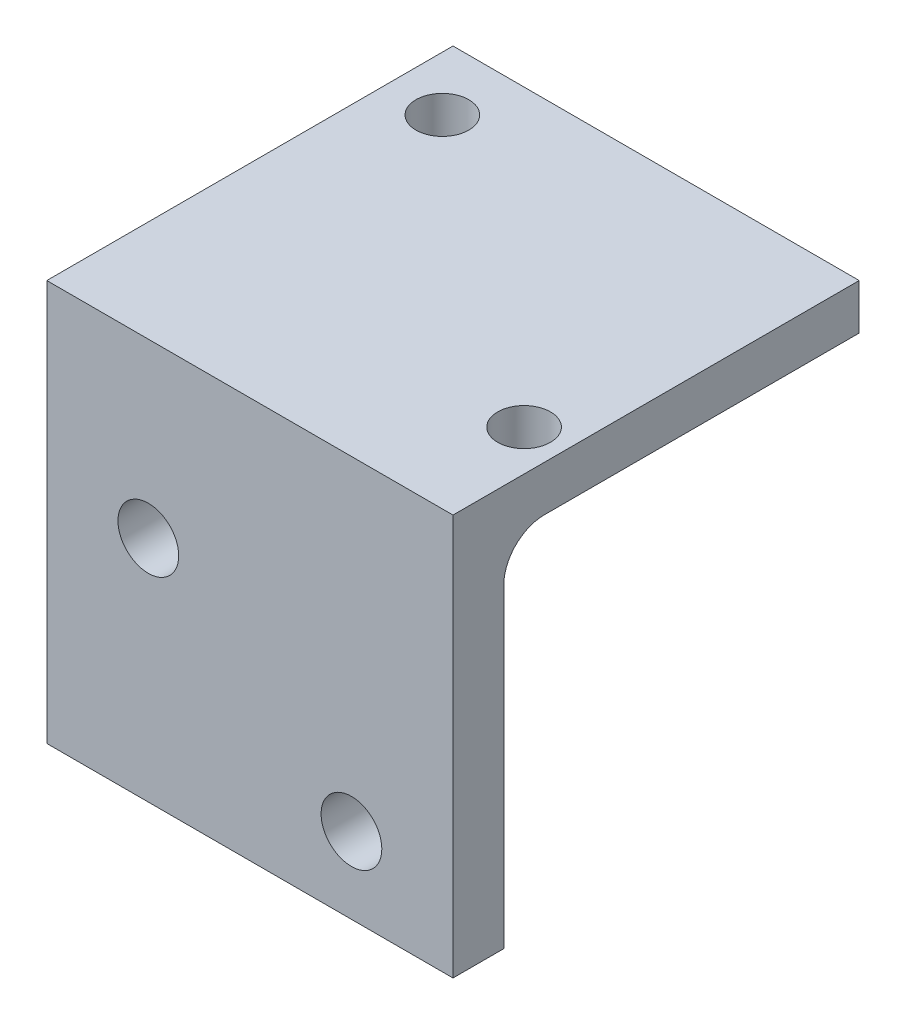
ISO-10303-21;
HEADER;
FILE_DESCRIPTION(('STEP AP214'),'2;1');
FILE_NAME('part.step','',(''),(''),'','','');
FILE_SCHEMA(('AUTOMOTIVE_DESIGN { 1 0 10303 214 1 1 1 1 }'));
ENDSEC;
DATA;
#1=APPLICATION_CONTEXT('core data for automotive mechanical design processes');
#2=APPLICATION_PROTOCOL_DEFINITION('international standard','automotive_design',2000,#1);
#3=PRODUCT_CONTEXT('',#1,'mechanical');
#4=PRODUCT('Part','Part','',(#3));
#5=PRODUCT_RELATED_PRODUCT_CATEGORY('part','',(#4));
#6=PRODUCT_DEFINITION_FORMATION('','',#4);
#7=PRODUCT_DEFINITION_CONTEXT('part definition',#1,'design');
#8=PRODUCT_DEFINITION('design','',#6,#7);
#9=PRODUCT_DEFINITION_SHAPE('','',#8);
#10=(LENGTH_UNIT() NAMED_UNIT(*) SI_UNIT(.MILLI.,.METRE.));
#11=(NAMED_UNIT(*) PLANE_ANGLE_UNIT() SI_UNIT($,.RADIAN.));
#12=(NAMED_UNIT(*) SI_UNIT($,.STERADIAN.) SOLID_ANGLE_UNIT());
#13=UNCERTAINTY_MEASURE_WITH_UNIT(LENGTH_MEASURE(1.E-05),#10,'distance_accuracy_value','');
#14=(GEOMETRIC_REPRESENTATION_CONTEXT(3) GLOBAL_UNCERTAINTY_ASSIGNED_CONTEXT((#13)) GLOBAL_UNIT_ASSIGNED_CONTEXT((#10,
#11,#12)) REPRESENTATION_CONTEXT('',''));
#15=CARTESIAN_POINT('',(0.,0.,0.));
#16=DIRECTION('',(0.,0.,1.));
#17=DIRECTION('',(1.,0.,0.));
#18=AXIS2_PLACEMENT_3D('',#15,#16,#17);
#19=CARTESIAN_POINT('',(0.,0.,0.));
#20=DIRECTION('',(0.,1.,0.));
#21=DIRECTION('',(0.,0.,1.));
#22=AXIS2_PLACEMENT_3D('',#19,#20,#21);
#23=PLANE('',#22);
#24=DIRECTION('',(0.,0.,1.));
#25=VECTOR('',#24,1.);
#26=CARTESIAN_POINT('',(-0.174879010729016,0.,0.));
#27=LINE('',#26,#25);
#28=CARTESIAN_POINT('',(-0.174879010729018,0.,-19.2947768193784));
#29=VERTEX_POINT('',#28);
#30=CARTESIAN_POINT('',(-0.174879010729016,0.,0.390223180621607));
#31=VERTEX_POINT('',#30);
#32=EDGE_CURVE('E143',#29,#31,#27,.T.);
#33=ORIENTED_EDGE('',*,*,#32,.T.);
#34=DIRECTION('',(1.,0.,0.));
#35=VECTOR('',#34,1.);
#36=CARTESIAN_POINT('',(-25.574879010729,0.,0.390223180621603));
#37=LINE('',#36,#35);
#38=CARTESIAN_POINT('',(-1.65993778013843,0.,0.390223180621607));
#39=VERTEX_POINT('',#38);
#40=EDGE_CURVE('E194',#31,#39,#37,.F.);
#41=ORIENTED_EDGE('',*,*,#40,.T.);
#42=CARTESIAN_POINT('',(-2.71487901072902,0.,-0.879776819378402));
#43=DIRECTION('',(0.,1.,0.));
#44=DIRECTION('',(0.,0.,1.));
#45=AXIS2_PLACEMENT_3D('',#42,#43,#44);
#46=CIRCLE('',#45,1.651);
#47=CARTESIAN_POINT('',(-3.7698202413196,0.,0.390223180621606));
#48=VERTEX_POINT('',#47);
#49=EDGE_CURVE('E214',#39,#48,#46,.T.);
#50=ORIENTED_EDGE('',*,*,#49,.T.);
#51=DIRECTION('',(1.,0.,0.));
#52=VECTOR('',#51,1.);
#53=CARTESIAN_POINT('',(-25.574879010729,0.,0.390223180621603));
#54=LINE('',#53,#52);
#55=CARTESIAN_POINT('',(-25.574879010729,0.,0.390223180621603));
#56=VERTEX_POINT('',#55);
#57=EDGE_CURVE('E65',#48,#56,#54,.F.);
#58=ORIENTED_EDGE('',*,*,#57,.T.);
#59=DIRECTION('',(0.,0.,1.));
#60=VECTOR('',#59,1.);
#61=CARTESIAN_POINT('',(-25.574879010729,0.,0.));
#62=LINE('',#61,#60);
#63=CARTESIAN_POINT('',(-25.574879010729,0.,-19.2947768193784));
#64=VERTEX_POINT('',#63);
#65=EDGE_CURVE('E235',#64,#56,#62,.T.);
#66=ORIENTED_EDGE('',*,*,#65,.F.);
#67=DIRECTION('',(-1.,0.,0.));
#68=VECTOR('',#67,1.);
#69=CARTESIAN_POINT('',(0.,0.,-19.2947768193784));
#70=LINE('',#69,#68);
#71=EDGE_CURVE('E229',#29,#64,#70,.T.);
#72=ORIENTED_EDGE('',*,*,#71,.F.);
#73=EDGE_LOOP('',(#33,#41,#50,#58,#66,#72));
#74=FACE_BOUND('',#73,.T.);
#75=CARTESIAN_POINT('',(-22.1757384213511,0.,-15.2307768193784));
#76=DIRECTION('',(0.,1.,0.));
#77=DIRECTION('',(0.,0.,1.));
#78=AXIS2_PLACEMENT_3D('',#75,#76,#77);
#79=CIRCLE('',#78,1.651);
#80=CARTESIAN_POINT('',(-22.1757384213511,0.,-13.5797768193784));
#81=VERTEX_POINT('',#80);
#82=EDGE_CURVE('E140',#81,#81,#79,.T.);
#83=ORIENTED_EDGE('',*,*,#82,.T.);
#84=EDGE_LOOP('',(#83));
#85=FACE_BOUND('',#84,.T.);
#86=ADVANCED_FACE('F37',(#74,#85),#23,.F.);
#87=CARTESIAN_POINT('',(-0.174879010729016,2.8448,0.));
#88=DIRECTION('',(1.,0.,0.));
#89=DIRECTION('',(0.,0.,-1.));
#90=AXIS2_PLACEMENT_3D('',#87,#88,#89);
#91=PLANE('',#90);
#92=ORIENTED_EDGE('',*,*,#32,.F.);
#93=DIRECTION('',(0.,-1.,0.));
#94=VECTOR('',#93,1.);
#95=CARTESIAN_POINT('',(-0.174879010729018,2.8448,-19.2947768193784));
#96=LINE('',#95,#94);
#97=CARTESIAN_POINT('',(-0.174879010729018,2.8448,-19.2947768193784));
#98=VERTEX_POINT('',#97);
#99=EDGE_CURVE('E154',#98,#29,#96,.T.);
#100=ORIENTED_EDGE('',*,*,#99,.F.);
#101=DIRECTION('',(0.,0.,1.));
#102=VECTOR('',#101,1.);
#103=CARTESIAN_POINT('',(-0.174879010729016,2.8448,0.));
#104=LINE('',#103,#102);
#105=CARTESIAN_POINT('',(-0.174879010729016,2.8448,6.1052231806216));
#106=VERTEX_POINT('',#105);
#107=EDGE_CURVE('E213',#98,#106,#104,.T.);
#108=ORIENTED_EDGE('',*,*,#107,.T.);
#109=DIRECTION('',(0.,-1.,0.));
#110=VECTOR('',#109,1.);
#111=CARTESIAN_POINT('',(-0.174879010729016,2.8448,6.1052231806216));
#112=LINE('',#111,#110);
#113=CARTESIAN_POINT('',(-0.174879010729018,-22.225,6.10522318062161));
#114=VERTEX_POINT('',#113);
#115=EDGE_CURVE('E206',#106,#114,#112,.T.);
#116=ORIENTED_EDGE('',*,*,#115,.T.);
#117=DIRECTION('',(0.,0.,1.));
#118=VECTOR('',#117,1.);
#119=CARTESIAN_POINT('',(-0.174879010729018,-22.225,6.10522318062161));
#120=LINE('',#119,#118);
#121=CARTESIAN_POINT('',(-0.174879010729018,-22.225,2.93022318062161));
#122=VERTEX_POINT('',#121);
#123=EDGE_CURVE('E126',#122,#114,#120,.T.);
#124=ORIENTED_EDGE('',*,*,#123,.F.);
#125=DIRECTION('',(0.,1.,0.));
#126=VECTOR('',#125,1.);
#127=CARTESIAN_POINT('',(-0.174879010729018,-22.225,2.93022318062161));
#128=LINE('',#127,#126);
#129=CARTESIAN_POINT('',(-0.174879010729018,-2.54,2.93022318062161));
#130=VERTEX_POINT('',#129);
#131=EDGE_CURVE('E122',#122,#130,#128,.T.);
#132=ORIENTED_EDGE('',*,*,#131,.T.);
#133=CARTESIAN_POINT('',(-0.174879010729018,-2.54,0.390223180621607));
#134=DIRECTION('',(1.,0.,0.));
#135=DIRECTION('',(0.,0.,-1.));
#136=AXIS2_PLACEMENT_3D('',#133,#134,#135);
#137=CIRCLE('',#136,2.54);
#138=EDGE_CURVE('E50',#130,#31,#137,.F.);
#139=ORIENTED_EDGE('',*,*,#138,.T.);
#140=EDGE_LOOP('',(#92,#100,#108,#116,#124,#132,#139));
#141=FACE_BOUND('',#140,.T.);
#142=ADVANCED_FACE('F204',(#141),#91,.T.);
#143=CARTESIAN_POINT('',(0.,2.8448,-19.2947768193784));
#144=DIRECTION('',(0.,0.,1.));
#145=DIRECTION('',(1.,0.,0.));
#146=AXIS2_PLACEMENT_3D('',#143,#144,#145);
#147=PLANE('',#146);
#148=ORIENTED_EDGE('',*,*,#71,.T.);
#149=DIRECTION('',(0.,-1.,0.));
#150=VECTOR('',#149,1.);
#151=CARTESIAN_POINT('',(-25.574879010729,2.8448,-19.2947768193784));
#152=LINE('',#151,#150);
#153=CARTESIAN_POINT('',(-25.574879010729,2.8448,-19.2947768193784));
#154=VERTEX_POINT('',#153);
#155=EDGE_CURVE('E241',#154,#64,#152,.T.);
#156=ORIENTED_EDGE('',*,*,#155,.F.);
#157=DIRECTION('',(-1.,0.,0.));
#158=VECTOR('',#157,1.);
#159=CARTESIAN_POINT('',(0.,2.8448,-19.2947768193784));
#160=LINE('',#159,#158);
#161=EDGE_CURVE('E216',#98,#154,#160,.T.);
#162=ORIENTED_EDGE('',*,*,#161,.F.);
#163=ORIENTED_EDGE('',*,*,#99,.T.);
#164=EDGE_LOOP('',(#148,#156,#162,#163));
#165=FACE_BOUND('',#164,.T.);
#166=ADVANCED_FACE('F248',(#165),#147,.F.);
#167=CARTESIAN_POINT('',(-25.574879010729,2.8448,0.));
#168=DIRECTION('',(1.,0.,0.));
#169=DIRECTION('',(0.,0.,-1.));
#170=AXIS2_PLACEMENT_3D('',#167,#168,#169);
#171=PLANE('',#170);
#172=ORIENTED_EDGE('',*,*,#65,.T.);
#173=CARTESIAN_POINT('',(-25.574879010729,-2.54,0.390223180621603));
#174=DIRECTION('',(1.,0.,0.));
#175=DIRECTION('',(0.,0.,-1.));
#176=AXIS2_PLACEMENT_3D('',#173,#174,#175);
#177=CIRCLE('',#176,2.54);
#178=CARTESIAN_POINT('',(-25.574879010729,-2.54,2.9302231806216));
#179=VERTEX_POINT('',#178);
#180=EDGE_CURVE('E11',#56,#179,#177,.T.);
#181=ORIENTED_EDGE('',*,*,#180,.T.);
#182=DIRECTION('',(0.,1.,0.));
#183=VECTOR('',#182,1.);
#184=CARTESIAN_POINT('',(-25.574879010729,-22.225,2.9302231806216));
#185=LINE('',#184,#183);
#186=CARTESIAN_POINT('',(-25.574879010729,-22.225,2.9302231806216));
#187=VERTEX_POINT('',#186);
#188=EDGE_CURVE('E120',#187,#179,#185,.T.);
#189=ORIENTED_EDGE('',*,*,#188,.F.);
#190=DIRECTION('',(0.,0.,-1.));
#191=VECTOR('',#190,1.);
#192=CARTESIAN_POINT('',(-25.574879010729,-22.225,6.1052231806216));
#193=LINE('',#192,#191);
#194=CARTESIAN_POINT('',(-25.574879010729,-22.225,6.1052231806216));
#195=VERTEX_POINT('',#194);
#196=EDGE_CURVE('E127',#195,#187,#193,.T.);
#197=ORIENTED_EDGE('',*,*,#196,.F.);
#198=DIRECTION('',(0.,-1.,0.));
#199=VECTOR('',#198,1.);
#200=CARTESIAN_POINT('',(-25.574879010729,2.8448,6.1052231806216));
#201=LINE('',#200,#199);
#202=CARTESIAN_POINT('',(-25.574879010729,2.8448,6.1052231806216));
#203=VERTEX_POINT('',#202);
#204=EDGE_CURVE('E240',#203,#195,#201,.T.);
#205=ORIENTED_EDGE('',*,*,#204,.F.);
#206=DIRECTION('',(0.,0.,1.));
#207=VECTOR('',#206,1.);
#208=CARTESIAN_POINT('',(-25.574879010729,2.8448,0.));
#209=LINE('',#208,#207);
#210=EDGE_CURVE('E219',#154,#203,#209,.T.);
#211=ORIENTED_EDGE('',*,*,#210,.F.);
#212=ORIENTED_EDGE('',*,*,#155,.T.);
#213=EDGE_LOOP('',(#172,#181,#189,#197,#205,#211,#212));
#214=FACE_BOUND('',#213,.T.);
#215=ADVANCED_FACE('F138',(#214),#171,.F.);
#216=CARTESIAN_POINT('',(0.,2.8448,6.1052231806216));
#217=DIRECTION('',(0.,0.,1.));
#218=DIRECTION('',(1.,0.,0.));
#219=AXIS2_PLACEMENT_3D('',#216,#217,#218);
#220=PLANE('',#219);
#221=CARTESIAN_POINT('',(-6.52487901072902,-17.4625,6.1052231806216));
#222=DIRECTION('',(0.,0.,1.));
#223=DIRECTION('',(1.,0.,0.));
#224=AXIS2_PLACEMENT_3D('',#221,#222,#223);
#225=CIRCLE('',#224,1.89864999999999);
#226=CARTESIAN_POINT('',(-4.62622901072903,-17.4625,6.1052231806216));
#227=VERTEX_POINT('',#226);
#228=EDGE_CURVE('E280',#227,#227,#225,.T.);
#229=ORIENTED_EDGE('',*,*,#228,.F.);
#230=EDGE_LOOP('',(#229));
#231=FACE_BOUND('',#230,.T.);
#232=CARTESIAN_POINT('',(-19.224879010729,-7.9375,6.1052231806216));
#233=DIRECTION('',(0.,0.,1.));
#234=DIRECTION('',(1.,0.,0.));
#235=AXIS2_PLACEMENT_3D('',#232,#233,#234);
#236=CIRCLE('',#235,1.89864999999999);
#237=CARTESIAN_POINT('',(-17.326229010729,-7.9375,6.1052231806216));
#238=VERTEX_POINT('',#237);
#239=EDGE_CURVE('E191',#238,#238,#236,.T.);
#240=ORIENTED_EDGE('',*,*,#239,.F.);
#241=EDGE_LOOP('',(#240));
#242=FACE_BOUND('',#241,.T.);
#243=ORIENTED_EDGE('',*,*,#204,.T.);
#244=DIRECTION('',(-1.,0.,0.));
#245=VECTOR('',#244,1.);
#246=CARTESIAN_POINT('',(-25.574879010729,-22.225,6.1052231806216));
#247=LINE('',#246,#245);
#248=EDGE_CURVE('E133',#114,#195,#247,.T.);
#249=ORIENTED_EDGE('',*,*,#248,.F.);
#250=ORIENTED_EDGE('',*,*,#115,.F.);
#251=DIRECTION('',(-1.,0.,0.));
#252=VECTOR('',#251,1.);
#253=CARTESIAN_POINT('',(0.,2.8448,6.1052231806216));
#254=LINE('',#253,#252);
#255=EDGE_CURVE('E221',#106,#203,#254,.T.);
#256=ORIENTED_EDGE('',*,*,#255,.T.);
#257=EDGE_LOOP('',(#243,#249,#250,#256));
#258=FACE_BOUND('',#257,.T.);
#259=ADVANCED_FACE('F261',(#231,#242,#258),#220,.T.);
#260=CARTESIAN_POINT('',(-22.1757384213511,2.8448,-15.2307768193784));
#261=DIRECTION('',(0.,-1.,0.));
#262=DIRECTION('',(0.,0.,-1.));
#263=AXIS2_PLACEMENT_3D('',#260,#261,#262);
#264=CYLINDRICAL_SURFACE('',#263,1.651);
#265=CARTESIAN_POINT('',(-22.1757384213511,2.8448,-15.2307768193784));
#266=DIRECTION('',(0.,1.,0.));
#267=DIRECTION('',(0.,0.,1.));
#268=AXIS2_PLACEMENT_3D('',#265,#266,#267);
#269=CIRCLE('',#268,1.651);
#270=CARTESIAN_POINT('',(-22.1757384213511,2.8448,-13.5797768193784));
#271=VERTEX_POINT('',#270);
#272=EDGE_CURVE('E210',#271,#271,#269,.T.);
#273=ORIENTED_EDGE('',*,*,#272,.T.);
#274=EDGE_LOOP('',(#273));
#275=FACE_BOUND('',#274,.T.);
#276=ORIENTED_EDGE('',*,*,#82,.F.);
#277=EDGE_LOOP('',(#276));
#278=FACE_BOUND('',#277,.T.);
#279=ADVANCED_FACE('F170',(#275,#278),#264,.F.);
#280=CARTESIAN_POINT('',(-2.71487901072902,2.8448,-0.879776819378402));
#281=DIRECTION('',(0.,-1.,0.));
#282=DIRECTION('',(0.,0.,-1.));
#283=AXIS2_PLACEMENT_3D('',#280,#281,#282);
#284=CYLINDRICAL_SURFACE('',#283,1.651);
#285=CARTESIAN_POINT('',(-2.71487901072902,2.8448,-0.879776819378402));
#286=DIRECTION('',(0.,1.,0.));
#287=DIRECTION('',(0.,0.,1.));
#288=AXIS2_PLACEMENT_3D('',#285,#286,#287);
#289=CIRCLE('',#288,1.651);
#290=CARTESIAN_POINT('',(-2.71487901072902,2.8448,0.771223180621597));
#291=VERTEX_POINT('',#290);
#292=EDGE_CURVE('E224',#291,#291,#289,.T.);
#293=ORIENTED_EDGE('',*,*,#292,.T.);
#294=EDGE_LOOP('',(#293));
#295=FACE_BOUND('',#294,.T.);
#296=ORIENTED_EDGE('',*,*,#49,.F.);
#297=EDGE_CURVE('E201',#48,#39,#46,.T.);
#298=ORIENTED_EDGE('',*,*,#297,.F.);
#299=EDGE_LOOP('',(#296,#298));
#300=FACE_BOUND('',#299,.T.);
#301=ADVANCED_FACE('F183',(#295,#300),#284,.F.);
#302=CARTESIAN_POINT('',(0.,2.8448,0.));
#303=DIRECTION('',(0.,1.,0.));
#304=DIRECTION('',(0.,0.,1.));
#305=AXIS2_PLACEMENT_3D('',#302,#303,#304);
#306=PLANE('',#305);
#307=ORIENTED_EDGE('',*,*,#272,.F.);
#308=EDGE_LOOP('',(#307));
#309=FACE_BOUND('',#308,.T.);
#310=ORIENTED_EDGE('',*,*,#107,.F.);
#311=ORIENTED_EDGE('',*,*,#161,.T.);
#312=ORIENTED_EDGE('',*,*,#210,.T.);
#313=ORIENTED_EDGE('',*,*,#255,.F.);
#314=EDGE_LOOP('',(#310,#311,#312,#313));
#315=FACE_BOUND('',#314,.T.);
#316=ORIENTED_EDGE('',*,*,#292,.F.);
#317=EDGE_LOOP('',(#316));
#318=FACE_BOUND('',#317,.T.);
#319=ADVANCED_FACE('F254',(#309,#315,#318),#306,.T.);
#320=CARTESIAN_POINT('',(-25.574879010729,-22.225,2.9302231806216));
#321=DIRECTION('',(0.,0.,1.));
#322=DIRECTION('',(1.,0.,0.));
#323=AXIS2_PLACEMENT_3D('',#320,#321,#322);
#324=PLANE('',#323);
#325=CARTESIAN_POINT('',(-6.52487901072902,-17.4625,2.93022318062161));
#326=DIRECTION('',(0.,0.,-1.));
#327=DIRECTION('',(-1.,0.,0.));
#328=AXIS2_PLACEMENT_3D('',#325,#326,#327);
#329=CIRCLE('',#328,1.89864999999999);
#330=CARTESIAN_POINT('',(-8.42352901072901,-17.4625,2.93022318062161));
#331=VERTEX_POINT('',#330);
#332=EDGE_CURVE('E295',#331,#331,#329,.T.);
#333=ORIENTED_EDGE('',*,*,#332,.F.);
#334=EDGE_LOOP('',(#333));
#335=FACE_BOUND('',#334,.T.);
#336=CARTESIAN_POINT('',(-19.224879010729,-7.9375,2.9302231806216));
#337=DIRECTION('',(0.,0.,-1.));
#338=DIRECTION('',(-1.,0.,0.));
#339=AXIS2_PLACEMENT_3D('',#336,#337,#338);
#340=CIRCLE('',#339,1.89864999999999);
#341=CARTESIAN_POINT('',(-21.123529010729,-7.9375,2.9302231806216));
#342=VERTEX_POINT('',#341);
#343=EDGE_CURVE('E289',#342,#342,#340,.T.);
#344=ORIENTED_EDGE('',*,*,#343,.F.);
#345=EDGE_LOOP('',(#344));
#346=FACE_BOUND('',#345,.T.);
#347=ORIENTED_EDGE('',*,*,#188,.T.);
#348=DIRECTION('',(1.,0.,0.));
#349=VECTOR('',#348,1.);
#350=CARTESIAN_POINT('',(-0.174879010729018,-2.54,2.93022318062161));
#351=LINE('',#350,#349);
#352=CARTESIAN_POINT('',(-3.7698202413196,-2.54,2.93022318062161));
#353=VERTEX_POINT('',#352);
#354=EDGE_CURVE('E161',#179,#353,#351,.T.);
#355=ORIENTED_EDGE('',*,*,#354,.T.);
#356=CARTESIAN_POINT('',(-4.78046517238045,-2.41927019892084,2.93022318062161));
#357=CARTESIAN_POINT('',(-3.99617103158453,0.459293182931303,2.93022318062161));
#358=CARTESIAN_POINT('',(-4.1213101737523,0.,-0.0150500511579507));
#359=CARTESIAN_POINT('',(-4.72988987343305,-2.4330551308912,2.93022318062161));
#360=CARTESIAN_POINT('',(-4.00015061990601,0.441268070383023,2.93022318062161));
#361=CARTESIAN_POINT('',(-4.11184935456264,0.,0.000310450198388794));
#362=CARTESIAN_POINT('',(-4.67896269357026,-2.44551844006793,2.93022318062161));
#363=CARTESIAN_POINT('',(-4.00237563415633,0.421973515309005,2.93022318062161));
#364=CARTESIAN_POINT('',(-4.10159513334371,0.,0.0164495946423353));
#365=CARTESIAN_POINT('',(-4.57657613516394,-2.46791341952693,2.93022318062161));
#366=CARTESIAN_POINT('',(-4.00262718154944,0.381212904278227,2.93022318062161));
#367=CARTESIAN_POINT('',(-4.07907939563001,0.,0.0503763433396225));
#368=CARTESIAN_POINT('',(-4.52511699163838,-2.47784616190466,2.93022318062161));
#369=CARTESIAN_POINT('',(-4.00068775020279,0.359778117955345,2.93022318062161));
#370=CARTESIAN_POINT('',(-4.06681873280851,0.,0.0681632451372429));
#371=CARTESIAN_POINT('',(-4.42206118482059,-2.49525812395143,2.93022318062161));
#372=CARTESIAN_POINT('',(-3.99207350452714,0.315134175868423,2.93022318062161));
#373=CARTESIAN_POINT('',(-4.03993178780481,0.,0.1053933503395));
#374=CARTESIAN_POINT('',(-4.37046659768933,-2.50274972676771,2.93022318062161));
#375=CARTESIAN_POINT('',(-3.98546506186709,0.291965998608472,2.93022318062161));
#376=CARTESIAN_POINT('',(-4.02531802534768,0.,0.124827543473096));
#377=CARTESIAN_POINT('',(-4.26700274956601,-2.51551354936821,2.93022318062161));
#378=CARTESIAN_POINT('',(-3.96696759121091,0.244158137884545,2.93022318062161));
#379=CARTESIAN_POINT('',(-3.9931386225148,0.,0.165458670089539));
#380=CARTESIAN_POINT('',(-4.21513346262697,-2.52078555557149,2.93022318062161));
#381=CARTESIAN_POINT('',(-3.95513033854321,0.219546591780559,2.93022318062161));
#382=CARTESIAN_POINT('',(-3.9755726982944,0.,0.186655772973673));
#383=CARTESIAN_POINT('',(-4.05930889817225,-2.53354903938179,2.93022318062161));
#384=CARTESIAN_POINT('',(-3.91104737666477,0.144509915440862,2.93022318062161));
#385=CARTESIAN_POINT('',(-3.91752799359861,0.,0.252899623953501));
#386=CARTESIAN_POINT('',(-3.95509886050122,-2.53799411721139,2.93022318062161));
#387=CARTESIAN_POINT('',(-3.87019750325805,0.0923138824528808,2.93022318062161));
#388=CARTESIAN_POINT('',(-3.87169328127576,0.,0.300612576212144));
#389=CARTESIAN_POINT('',(-3.7986892634634,-2.54017655621838,2.93022318062161));
#390=CARTESIAN_POINT('',(-3.78781852789429,0.0142974384544925,2.93022318062161));
#391=CARTESIAN_POINT('',(-3.78749145238243,0.,0.375885062061884));
#392=CARTESIAN_POINT('',(-3.74649055182562,-2.54015448692261,2.93022318062161));
#393=CARTESIAN_POINT('',(-3.75712677086065,-0.0114797409311745,2.93022318062161));
#394=CARTESIAN_POINT('',(-3.75681507064494,0.,0.401617582189808));
#395=CARTESIAN_POINT('',(-3.64210496986102,-2.53896818025468,2.93022318062161));
#396=CARTESIAN_POINT('',(-3.68863190353018,-0.0619282436335028,2.93022318062161));
#397=CARTESIAN_POINT('',(-3.68943447512539,0.,0.453588028416098));
#398=CARTESIAN_POINT('',(-3.58991809937911,-2.53780395882217,2.93022318062161));
#399=CARTESIAN_POINT('',(-3.65090132539279,-0.086609548509501,2.93022318062161));
#400=CARTESIAN_POINT('',(-3.65273034547144,0.,0.4798259474562));
#401=CARTESIAN_POINT('',(-3.47020136390445,-2.53426918441061,2.93022318062161));
#402=CARTESIAN_POINT('',(-3.55621236341486,-0.140830305484294,2.93022318062161));
#403=CARTESIAN_POINT('',(-3.56072409579566,0.,0.539438243849741));
#404=CARTESIAN_POINT('',(-3.40268011612729,-2.53164430793399,2.93022318062161));
#405=CARTESIAN_POINT('',(-3.49679383359444,-0.169813417176816,2.93022318062161));
#406=CARTESIAN_POINT('',(-3.50312841221571,0.,0.572638174300059));
#407=CARTESIAN_POINT('',(-3.26764885136141,-2.52607794318948,2.93022318062161));
#408=CARTESIAN_POINT('',(-3.36666073212336,-0.222073489227773,2.93022318062161));
#409=CARTESIAN_POINT('',(-3.37576357886264,0.,0.63482937591095));
#410=CARTESIAN_POINT('',(-3.20013883509968,-2.5231364391566,2.93022318062161));
#411=CARTESIAN_POINT('',(-3.29596055852153,-0.245458596126369,2.93022318062161));
#412=CARTESIAN_POINT('',(-3.30599382283066,0.,0.663820437341497));
#413=CARTESIAN_POINT('',(-3.06518762879163,-2.51788510806121,2.93022318062161));
#414=CARTESIAN_POINT('',(-3.14566425692161,-0.284205958568586,2.93022318062161));
#415=CARTESIAN_POINT('',(-3.15560554121882,0.,0.713265455784777));
#416=CARTESIAN_POINT('',(-2.99774647750001,-2.51557438812208,2.93022318062161));
#417=CARTESIAN_POINT('',(-3.06592808918627,-0.29970789839991,2.93022318062161));
#418=CARTESIAN_POINT('',(-3.07500259394808,0.,0.733731501803916));
#419=CARTESIAN_POINT('',(-2.86283493836761,-2.51232056984434,2.93022318062161));
#420=CARTESIAN_POINT('',(-2.90143503152716,-0.320974929494095,2.93022318062161));
#421=CARTESIAN_POINT('',(-2.90693915777874,0.,0.762217452793961));
#422=CARTESIAN_POINT('',(-2.79536455467003,-2.51137731766128,2.93022318062161));
#423=CARTESIAN_POINT('',(-2.81634899665468,-0.326834593474441,2.93022318062161));
#424=CARTESIAN_POINT('',(-2.81947944145543,0.,0.770238757844595));
#425=CARTESIAN_POINT('',(-2.66041083505012,-2.51116775909808,2.93022318062161));
#426=CARTESIAN_POINT('',(-2.64623834105261,-0.328150285513753,2.93022318062161));
#427=CARTESIAN_POINT('',(-2.64409938695758,0.,0.772034393594719));
#428=CARTESIAN_POINT('',(-2.59292749869514,-2.51190170244486,2.93022318062161));
#429=CARTESIAN_POINT('',(-2.56079907243759,-0.323611171546179,2.93022318062161));
#430=CARTESIAN_POINT('',(-2.55617898213326,0.,0.765806602667314));
#431=CARTESIAN_POINT('',(-2.45798817953841,-2.51480558875327,2.93022318062161));
#432=CARTESIAN_POINT('',(-2.3950266818916,-0.304807037794562,2.93022318062161));
#433=CARTESIAN_POINT('',(-2.38647225200227,0.,0.740513452416084));
#434=CARTESIAN_POINT('',(-2.39053220038258,-2.51697568351553,2.93022318062161));
#435=CARTESIAN_POINT('',(-2.31434602871764,-0.290456349685507,2.93022318062161));
#436=CARTESIAN_POINT('',(-2.30468657615152,0.,0.721446736019281));
#437=CARTESIAN_POINT('',(-2.25555077542842,-2.52205731887145,2.93022318062161));
#438=CARTESIAN_POINT('',(-2.16178951993331,-0.253739680769598,2.93022318062161));
#439=CARTESIAN_POINT('',(-2.15157569403419,0.,0.674234979358684));
#440=CARTESIAN_POINT('',(-2.18802537598725,-2.5249699599793,2.93022318062161));
#441=CARTESIAN_POINT('',(-2.08974949288827,-0.231234014430854,2.93022318062161));
#442=CARTESIAN_POINT('',(-2.08026626385364,0.,0.64607644763109));
#443=CARTESIAN_POINT('',(-2.05296756566441,-2.53060246315846,2.93022318062161));
#444=CARTESIAN_POINT('',(-1.95677655747245,-0.18043910131438,2.93022318062161));
#445=CARTESIAN_POINT('',(-1.94980677135164,0.,0.585036384060931));
#446=CARTESIAN_POINT('',(-1.98543515510527,-2.53332233188166,2.93022318062161));
#447=CARTESIAN_POINT('',(-1.89583959953763,-0.15203671325964,2.93022318062161));
#448=CARTESIAN_POINT('',(-1.89065628933444,0.,0.552155015305176));
#449=CARTESIAN_POINT('',(-1.86352406457785,-2.53719801945049,2.93022318062161));
#450=CARTESIAN_POINT('',(-1.79666122514193,-0.0976206435572603,2.93022318062161));
#451=CARTESIAN_POINT('',(-1.79433183551406,0.,0.491705962159114));
#452=CARTESIAN_POINT('',(-1.80915244809063,-2.53855556182021,2.93022318062161));
#453=CARTESIAN_POINT('',(-1.75627841955207,-0.0721312839493183,2.93022318062161));
#454=CARTESIAN_POINT('',(-1.75512198790755,0.,0.46435477031628));
#455=CARTESIAN_POINT('',(-1.70038996354569,-2.54007732489508,2.93022318062161));
#456=CARTESIAN_POINT('',(-1.68310325538982,-0.0198687361202487,2.93022318062161));
#457=CARTESIAN_POINT('',(-1.68335211124524,0.,0.410098489312347));
#458=CARTESIAN_POINT('',(-1.6459990956757,-2.54024155693347,2.93022318062161));
#459=CARTESIAN_POINT('',(-1.6503914622273,0.00691790231815304,2.93022318062161));
#460=CARTESIAN_POINT('',(-1.65079201903744,0.,0.383193395916931));
#461=CARTESIAN_POINT('',(-1.53732903509732,-2.53898091032034,2.93022318062161));
#462=CARTESIAN_POINT('',(-1.59229465003887,0.0608131486226801,2.93022318062161));
#463=CARTESIAN_POINT('',(-1.59141648016262,0.,0.330677937622025));
#464=CARTESIAN_POINT('',(-1.48304981596339,-2.53755886023482,2.93022318062161));
#465=CARTESIAN_POINT('',(-1.56698257458702,0.0879165111799446,2.93022318062161));
#466=CARTESIAN_POINT('',(-1.5645909095269,0.,0.305065352997682));
#467=CARTESIAN_POINT('',(-1.37457656318478,-2.53279587327978,2.93022318062161));
#468=CARTESIAN_POINT('',(-1.5231274729156,0.141721530836342,2.93022318062161));
#469=CARTESIAN_POINT('',(-1.51567142745444,0.,0.255526268517891));
#470=CARTESIAN_POINT('',(-1.32038252278335,-2.52945509720709,2.93022318062161));
#471=CARTESIAN_POINT('',(-1.50466540903339,0.168404555082033,2.93022318062161));
#472=CARTESIAN_POINT('',(-1.49357711973212,0.,0.231599627562312));
#473=CARTESIAN_POINT('',(-1.21216240870825,-2.52057684725247,2.93022318062161));
#474=CARTESIAN_POINT('',(-1.47393718886212,0.220734838387683,2.93022318062161));
#475=CARTESIAN_POINT('',(-1.45327125017285,0.,0.185625009502021));
#476=CARTESIAN_POINT('',(-1.15813636314382,-2.51503902379525,2.93022318062161));
#477=CARTESIAN_POINT('',(-1.46174323376072,0.246354331770841,2.93022318062161));
#478=CARTESIAN_POINT('',(-1.43506030693274,0.,0.163577332040319));
#479=CARTESIAN_POINT('',(-1.05039028289814,-2.50154368299507,2.93022318062161));
#480=CARTESIAN_POINT('',(-1.44294766076644,0.296026908783885,2.93022318062161));
#481=CARTESIAN_POINT('',(-1.40181053251364,0.,0.121408112162926));
#482=CARTESIAN_POINT('',(-0.996670215816603,-2.49358642688955,2.93022318062161));
#483=CARTESIAN_POINT('',(-1.43640407119766,0.320047824346108,2.93022318062161));
#484=CARTESIAN_POINT('',(-1.38677135916062,0.,0.101286362104102));
#485=CARTESIAN_POINT('',(-0.889359346304556,-2.47501834013881,2.93022318062161));
#486=CARTESIAN_POINT('',(-1.42825615026559,0.366237090232189,2.93022318062161));
#487=CARTESIAN_POINT('',(-1.35918209211028,0.,0.0628016207182083));
#488=CARTESIAN_POINT('',(-0.835771186789722,-2.46439209602165,2.93022318062161));
#489=CARTESIAN_POINT('',(-1.42672815694721,0.388357792029464,2.93022318062161));
#490=CARTESIAN_POINT('',(-1.34664724331007,0.,0.0444497333176707));
#491=CARTESIAN_POINT('',(-0.729192150257619,-2.44037637821705,2.93022318062161));
#492=CARTESIAN_POINT('',(-1.42808354249572,0.430273102637092,2.93022318062161));
#493=CARTESIAN_POINT('',(-1.32370231360652,0.,0.00952052109820819));
#494=CARTESIAN_POINT('',(-0.676201571412126,-2.42698558432246,2.93022318062161));
#495=CARTESIAN_POINT('',(-1.43100424186966,0.450032331009209,2.93022318062161));
#496=CARTESIAN_POINT('',(-1.3132932526121,0.,-0.00705595010758302));
#497=CARTESIAN_POINT('',(-0.623608746671595,-2.41215072651113,2.93022318062161));
#498=CARTESIAN_POINT('',(-1.43577828032422,0.468393662619365,2.93022318062161));
#499=CARTESIAN_POINT('',(-1.30371468013431,0.,-0.0227959374112564));
#500=(BOUNDED_SURFACE() B_SPLINE_SURFACE(3,2,((#356,#357,#358),(#359,#360,#361),(#362,#363,
#364),(#365,#366,#367),(#368,#369,#370),(#371,#372,#373),(#374,#375,#376),(#377,#378,#379),
(#380,#381,#382),(#383,#384,#385),(#386,#387,#388),(#389,#390,#391),(#392,#393,#394),(#395,#396,
#397),(#398,#399,#400),(#401,#402,#403),(#404,#405,#406),(#407,#408,#409),(#410,#411,#412),
(#413,#414,#415),(#416,#417,#418),(#419,#420,#421),(#422,#423,#424),(#425,#426,#427),(#428,#429,
#430),(#431,#432,#433),(#434,#435,#436),(#437,#438,#439),(#440,#441,#442),(#443,#444,#445),
(#446,#447,#448),(#449,#450,#451),(#452,#453,#454),(#455,#456,#457),(#458,#459,#460),(#461,#462,
#463),(#464,#465,#466),(#467,#468,#469),(#470,#471,#472),(#473,#474,#475),(#476,#477,#478),
(#479,#480,#481),(#482,#483,#484),(#485,#486,#487),(#488,#489,#490),(#491,#492,#493),(#494,#495,
#496),(#497,#498,#499)),.UNSPECIFIED.,.F.,.F.,.F.) B_SPLINE_SURFACE_WITH_KNOTS((4,2,2,2,2,2,2,2,
2,2,2,2,2,2,2,2,2,2,2,2,2,2,2,4),(3,3),(0.,0.157231273416072,0.314395823321791,0.47075024407719,
0.627119706618246,0.939743336660921,1.09633367204704,1.25292182211793,1.45563483066435,
1.65835793703573,1.86079258253384,2.06320445172813,2.26564646110902,2.46810987194711,
2.67087511241173,2.87363335276405,3.03679045910279,3.19994601588421,3.36281110756972,
3.52566255250751,3.68853991936468,3.85139970583273,4.01522255219587,4.17912381366522),(0.,1.),
.UNSPECIFIED.) GEOMETRIC_REPRESENTATION_ITEM() RATIONAL_B_SPLINE_SURFACE(((1.,0.648245173347094,
1.),(1.,0.650577211853146,1.),(1.,0.653015265303103,1.),(1.,0.6581090908866,1.),(1.,
0.660764770188807,1.),(1.,0.666287234118297,1.),(1.,0.669152860007642,1.),(1.,0.675102905803961,
1.),(1.,0.678187346733085,1.),(1.,0.687755797935047,1.),(1.,0.694556976827656,1.),(1.,
0.705117060725819,1.),(1.,0.708700151409716,1.),(1.,0.715881462728337,1.),(1.,0.719479683151214,
1.),(1.,0.727594521707913,1.),(1.,0.732069459399554,1.),(1.,0.740383792265461,1.),(1.,
0.744223155770087,1.),(1.,0.750734185678078,1.),(1.,0.753407505859482,1.),(1.,0.757120194752568,
1.),(1.,0.758159747269371,1.),(1.,0.758392858864644,1.),(1.,0.757586143041982,1.),(1.,
0.754292504452952,1.),(1.,0.751805404070031,1.),(1.,0.745598563607445,1.),(1.,0.741876991453167,
1.),(1.,0.733733981763165,1.),(1.,0.729312568393496,1.),(1.,0.721103664203671,1.),(1.,
0.717361023463243,1.),(1.,0.709877775727566,1.),(1.,0.706137168713339,1.),(1.,0.698778970798778,
1.),(1.,0.695161172749091,1.),(1.,0.688111401927481,1.),(1.,0.684679413610337,1.),(1.,
0.678038209815331,1.),(1.,0.674829029884346,1.),(1.,0.668650276556413,1.),(1.,0.665680677334598,
1.),(1.,0.65996604102319,1.),(1.,0.657222435708854,1.),(1.,0.6519703631724,1.),(1.,
0.649462009129595,1.),(1.,0.647068021161051,1.))) REPRESENTATION_ITEM('') SURFACE());
#501=CARTESIAN_POINT('',(-4.78046517238045,-2.41927019892084,2.93022318062161));
#502=CARTESIAN_POINT('',(-4.72988987343305,-2.4330551308912,2.93022318062161));
#503=CARTESIAN_POINT('',(-4.67896269357026,-2.44551844006793,2.93022318062161));
#504=CARTESIAN_POINT('',(-4.57657613516394,-2.46791341952693,2.93022318062161));
#505=CARTESIAN_POINT('',(-4.52511699163838,-2.47784616190466,2.93022318062161));
#506=CARTESIAN_POINT('',(-4.42206118482059,-2.49525812395143,2.93022318062161));
#507=CARTESIAN_POINT('',(-4.37046659768933,-2.50274972676771,2.93022318062161));
#508=CARTESIAN_POINT('',(-4.26700274956601,-2.51551354936821,2.93022318062161));
#509=CARTESIAN_POINT('',(-4.21513346262697,-2.52078555557149,2.93022318062161));
#510=CARTESIAN_POINT('',(-4.05930889817225,-2.53354903938179,2.93022318062161));
#511=CARTESIAN_POINT('',(-3.95509886050122,-2.53799411721139,2.93022318062161));
#512=CARTESIAN_POINT('',(-3.7986892634634,-2.54017655621838,2.93022318062161));
#513=CARTESIAN_POINT('',(-3.74649055182562,-2.54015448692261,2.93022318062161));
#514=CARTESIAN_POINT('',(-3.64210496986102,-2.53896818025468,2.93022318062161));
#515=CARTESIAN_POINT('',(-3.58991809937911,-2.53780395882217,2.93022318062161));
#516=CARTESIAN_POINT('',(-3.47020136390445,-2.53426918441061,2.93022318062161));
#517=CARTESIAN_POINT('',(-3.40268011612729,-2.53164430793399,2.93022318062161));
#518=CARTESIAN_POINT('',(-3.26764885136141,-2.52607794318948,2.93022318062161));
#519=CARTESIAN_POINT('',(-3.20013883509968,-2.5231364391566,2.93022318062161));
#520=CARTESIAN_POINT('',(-3.06518762879163,-2.51788510806121,2.93022318062161));
#521=CARTESIAN_POINT('',(-2.99774647750001,-2.51557438812208,2.93022318062161));
#522=CARTESIAN_POINT('',(-2.86283493836761,-2.51232056984434,2.93022318062161));
#523=CARTESIAN_POINT('',(-2.79536455467003,-2.51137731766128,2.93022318062161));
#524=CARTESIAN_POINT('',(-2.66041083505012,-2.51116775909809,2.93022318062161));
#525=CARTESIAN_POINT('',(-2.59292749869514,-2.51190170244486,2.93022318062161));
#526=CARTESIAN_POINT('',(-2.45798817953841,-2.51480558875327,2.93022318062161));
#527=CARTESIAN_POINT('',(-2.39053220038258,-2.51697568351553,2.93022318062161));
#528=CARTESIAN_POINT('',(-2.25555077542841,-2.52205731887145,2.93022318062161));
#529=CARTESIAN_POINT('',(-2.18802537598725,-2.5249699599793,2.93022318062161));
#530=CARTESIAN_POINT('',(-2.05296756566441,-2.53060246315846,2.93022318062161));
#531=CARTESIAN_POINT('',(-1.98543515510527,-2.53332233188166,2.93022318062161));
#532=CARTESIAN_POINT('',(-1.86352406457785,-2.53719801945049,2.93022318062161));
#533=CARTESIAN_POINT('',(-1.80915244809063,-2.53855556182021,2.93022318062161));
#534=CARTESIAN_POINT('',(-1.70038996354569,-2.54007732489508,2.93022318062161));
#535=CARTESIAN_POINT('',(-1.6459990956757,-2.54024155693347,2.93022318062161));
#536=CARTESIAN_POINT('',(-1.53732903509732,-2.53898091032034,2.93022318062161));
#537=CARTESIAN_POINT('',(-1.48304981596339,-2.53755886023482,2.93022318062161));
#538=CARTESIAN_POINT('',(-1.37457656318478,-2.53279587327978,2.93022318062161));
#539=CARTESIAN_POINT('',(-1.32038252278335,-2.52945509720709,2.93022318062161));
#540=CARTESIAN_POINT('',(-1.21216240870825,-2.52057684725247,2.93022318062161));
#541=CARTESIAN_POINT('',(-1.15813636314382,-2.51503902379525,2.93022318062161));
#542=CARTESIAN_POINT('',(-1.05039028289814,-2.50154368299507,2.93022318062161));
#543=CARTESIAN_POINT('',(-0.996670215816603,-2.49358642688955,2.93022318062161));
#544=CARTESIAN_POINT('',(-0.889359346304556,-2.47501834013881,2.93022318062161));
#545=CARTESIAN_POINT('',(-0.835771186789722,-2.46439209602165,2.93022318062161));
#546=CARTESIAN_POINT('',(-0.729192150257619,-2.44037637821705,2.93022318062161));
#547=CARTESIAN_POINT('',(-0.676201571412126,-2.42698558432246,2.93022318062161));
#548=CARTESIAN_POINT('',(-0.623608746671595,-2.41215072651113,2.93022318062161));
#549=B_SPLINE_CURVE_WITH_KNOTS('',3,(#501,#502,#503,#504,#505,#506,#507,#508,#509,#510,#511,
#512,#513,#514,#515,#516,#517,#518,#519,#520,#521,#522,#523,#524,#525,#526,#527,#528,#529,#530,
#531,#532,#533,#534,#535,#536,#537,#538,#539,#540,#541,#542,#543,#544,#545,#546,#547,#548),
.UNSPECIFIED.,.F.,.F.,(4,2,2,2,2,2,2,2,2,2,2,2,2,2,2,2,2,2,2,2,2,2,2,4),(0.,0.157231273416072,
0.314395823321791,0.47075024407719,0.627119706618246,0.939743336660921,1.09633367204704,
1.25292182211793,1.45563483066435,1.65835793703573,1.86079258253384,2.06320445172813,
2.26564646110902,2.46810987194711,2.67087511241173,2.87363335276405,3.03679045910279,
3.19994601588421,3.36281110756972,3.52566255250751,3.68853991936468,3.85139970583273,
4.01522255219587,4.17912381366522),.UNSPECIFIED.);
#550=CARTESIAN_POINT('',(-1.65993778013843,-2.54,2.93022318062161));
#551=VERTEX_POINT('',#550);
#552=EDGE_CURVE('E153',#353,#551,#549,.T.);
#553=ORIENTED_EDGE('',*,*,#552,.T.);
#554=DIRECTION('',(1.,0.,0.));
#555=VECTOR('',#554,1.);
#556=CARTESIAN_POINT('',(-0.174879010729018,-2.54,2.93022318062161));
#557=LINE('',#556,#555);
#558=EDGE_CURVE('E151',#551,#130,#557,.T.);
#559=ORIENTED_EDGE('',*,*,#558,.T.);
#560=ORIENTED_EDGE('',*,*,#131,.F.);
#561=DIRECTION('',(1.,0.,0.));
#562=VECTOR('',#561,1.);
#563=CARTESIAN_POINT('',(-25.574879010729,-22.225,2.9302231806216));
#564=LINE('',#563,#562);
#565=EDGE_CURVE('E115',#187,#122,#564,.T.);
#566=ORIENTED_EDGE('',*,*,#565,.F.);
#567=EDGE_LOOP('',(#347,#355,#553,#559,#560,#566));
#568=FACE_BOUND('',#567,.T.);
#569=ADVANCED_FACE('F117',(#335,#346,#568),#324,.F.);
#570=CARTESIAN_POINT('',(0.,-22.225,0.));
#571=DIRECTION('',(0.,-1.,0.));
#572=DIRECTION('',(0.,0.,-1.));
#573=AXIS2_PLACEMENT_3D('',#570,#571,#572);
#574=PLANE('',#573);
#575=ORIENTED_EDGE('',*,*,#196,.T.);
#576=ORIENTED_EDGE('',*,*,#565,.T.);
#577=ORIENTED_EDGE('',*,*,#123,.T.);
#578=ORIENTED_EDGE('',*,*,#248,.T.);
#579=EDGE_LOOP('',(#575,#576,#577,#578));
#580=FACE_BOUND('',#579,.T.);
#581=ADVANCED_FACE('F131',(#580),#574,.T.);
#582=CARTESIAN_POINT('',(-25.574879010729,-2.54,0.390223180621603));
#583=DIRECTION('',(-1.,0.,0.));
#584=DIRECTION('',(0.,0.,1.));
#585=AXIS2_PLACEMENT_3D('',#582,#583,#584);
#586=CYLINDRICAL_SURFACE('',#585,2.54);
#587=ORIENTED_EDGE('',*,*,#138,.F.);
#588=ORIENTED_EDGE('',*,*,#558,.F.);
#589=CARTESIAN_POINT('',(-1.65993778013843,-2.54,0.390223180621607));
#590=DIRECTION('',(1.,0.,0.));
#591=DIRECTION('',(0.,0.,-1.));
#592=AXIS2_PLACEMENT_3D('',#589,#590,#591);
#593=CIRCLE('',#592,2.54);
#594=EDGE_CURVE('E136',#39,#551,#593,.T.);
#595=ORIENTED_EDGE('',*,*,#594,.F.);
#596=ORIENTED_EDGE('',*,*,#40,.F.);
#597=EDGE_LOOP('',(#587,#588,#595,#596));
#598=FACE_BOUND('',#597,.T.);
#599=ADVANCED_FACE('F39',(#598),#586,.F.);
#600=ORIENTED_EDGE('',*,*,#594,.T.);
#601=ORIENTED_EDGE('',*,*,#552,.F.);
#602=CARTESIAN_POINT('',(-3.7698202413196,-2.54,0.390223180621606));
#603=DIRECTION('',(-1.,0.,0.));
#604=DIRECTION('',(0.,0.,1.));
#605=AXIS2_PLACEMENT_3D('',#602,#603,#604);
#606=CIRCLE('',#605,2.54);
#607=EDGE_CURVE('E190',#48,#353,#606,.F.);
#608=ORIENTED_EDGE('',*,*,#607,.F.);
#609=ORIENTED_EDGE('',*,*,#297,.T.);
#610=EDGE_LOOP('',(#600,#601,#608,#609));
#611=FACE_BOUND('',#610,.T.);
#612=ADVANCED_FACE('F173',(#611),#500,.F.);
#613=CARTESIAN_POINT('',(-25.574879010729,-2.54,0.390223180621603));
#614=DIRECTION('',(-1.,0.,0.));
#615=DIRECTION('',(0.,0.,1.));
#616=AXIS2_PLACEMENT_3D('',#613,#614,#615);
#617=CYLINDRICAL_SURFACE('',#616,2.54);
#618=ORIENTED_EDGE('',*,*,#180,.F.);
#619=ORIENTED_EDGE('',*,*,#57,.F.);
#620=ORIENTED_EDGE('',*,*,#607,.T.);
#621=ORIENTED_EDGE('',*,*,#354,.F.);
#622=EDGE_LOOP('',(#618,#619,#620,#621));
#623=FACE_BOUND('',#622,.T.);
#624=ADVANCED_FACE('F172',(#623),#617,.F.);
#625=CARTESIAN_POINT('',(-19.224879010729,-7.9375,2.9302231806216));
#626=DIRECTION('',(0.,0.,-1.));
#627=DIRECTION('',(-1.,0.,0.));
#628=AXIS2_PLACEMENT_3D('',#625,#626,#627);
#629=CYLINDRICAL_SURFACE('',#628,1.89864999999999);
#630=ORIENTED_EDGE('',*,*,#239,.T.);
#631=EDGE_LOOP('',(#630));
#632=FACE_BOUND('',#631,.T.);
#633=ORIENTED_EDGE('',*,*,#343,.T.);
#634=EDGE_LOOP('',(#633));
#635=FACE_BOUND('',#634,.T.);
#636=ADVANCED_FACE('F305',(#632,#635),#629,.F.);
#637=CARTESIAN_POINT('',(-6.52487901072902,-17.4625,2.93022318062161));
#638=DIRECTION('',(0.,0.,-1.));
#639=DIRECTION('',(-1.,0.,0.));
#640=AXIS2_PLACEMENT_3D('',#637,#638,#639);
#641=CYLINDRICAL_SURFACE('',#640,1.89864999999999);
#642=ORIENTED_EDGE('',*,*,#228,.T.);
#643=EDGE_LOOP('',(#642));
#644=FACE_BOUND('',#643,.T.);
#645=ORIENTED_EDGE('',*,*,#332,.T.);
#646=EDGE_LOOP('',(#645));
#647=FACE_BOUND('',#646,.T.);
#648=ADVANCED_FACE('F299',(#644,#647),#641,.F.);
#649=CLOSED_SHELL('',(#86,#142,#166,#215,#259,#279,#301,#319,#569,#581,#599,#612,#624,#636,#648));
#650=MANIFOLD_SOLID_BREP('B2',#649);
#651=ADVANCED_BREP_SHAPE_REPRESENTATION('',(#18,#650),#14);
#652=SHAPE_DEFINITION_REPRESENTATION(#9,#651);
ENDSEC;
END-ISO-10303-21;
